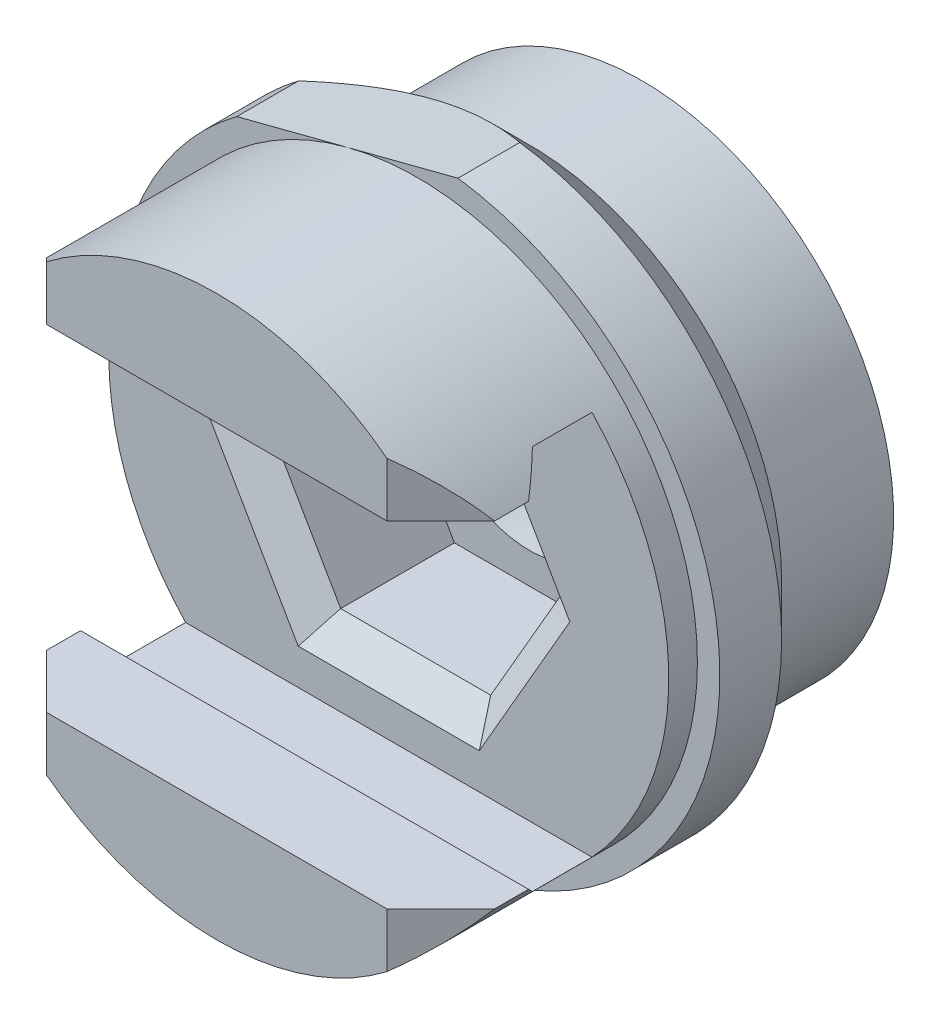
ISO-10303-21;
HEADER;
FILE_DESCRIPTION(('STEP AP214'),'2;1');
FILE_NAME('part.step','',(''),(''),'','','');
FILE_SCHEMA(('AUTOMOTIVE_DESIGN { 1 0 10303 214 1 1 1 1 }'));
ENDSEC;
DATA;
#1=APPLICATION_CONTEXT('core data for automotive mechanical design processes');
#2=APPLICATION_PROTOCOL_DEFINITION('international standard','automotive_design',2000,#1);
#3=PRODUCT_CONTEXT('',#1,'mechanical');
#4=PRODUCT('Part','Part','',(#3));
#5=PRODUCT_RELATED_PRODUCT_CATEGORY('part','',(#4));
#6=PRODUCT_DEFINITION_FORMATION('','',#4);
#7=PRODUCT_DEFINITION_CONTEXT('part definition',#1,'design');
#8=PRODUCT_DEFINITION('design','',#6,#7);
#9=PRODUCT_DEFINITION_SHAPE('','',#8);
#10=(LENGTH_UNIT() NAMED_UNIT(*) SI_UNIT(.MILLI.,.METRE.));
#11=(NAMED_UNIT(*) PLANE_ANGLE_UNIT() SI_UNIT($,.RADIAN.));
#12=(NAMED_UNIT(*) SI_UNIT($,.STERADIAN.) SOLID_ANGLE_UNIT());
#13=UNCERTAINTY_MEASURE_WITH_UNIT(LENGTH_MEASURE(1.E-05),#10,'distance_accuracy_value','');
#14=(GEOMETRIC_REPRESENTATION_CONTEXT(3) GLOBAL_UNCERTAINTY_ASSIGNED_CONTEXT((#13)) GLOBAL_UNIT_ASSIGNED_CONTEXT((#10,
#11,#12)) REPRESENTATION_CONTEXT('',''));
#15=CARTESIAN_POINT('',(0.,0.,0.));
#16=DIRECTION('',(0.,0.,1.));
#17=DIRECTION('',(1.,0.,0.));
#18=AXIS2_PLACEMENT_3D('',#15,#16,#17);
#19=CARTESIAN_POINT('',(-4.0005,0.,-4.7625));
#20=DIRECTION('',(0.,0.,1.));
#21=DIRECTION('',(1.,0.,0.));
#22=AXIS2_PLACEMENT_3D('',#19,#20,#21);
#23=PLANE('',#22);
#24=CARTESIAN_POINT('',(0.,0.,-4.7625));
#25=DIRECTION('',(0.,0.,-1.));
#26=DIRECTION('',(0.,1.,0.));
#27=AXIS2_PLACEMENT_3D('',#24,#25,#26);
#28=CIRCLE('',#27,2.80669999999999);
#29=CARTESIAN_POINT('',(0.,2.80669999999999,-4.7625));
#30=VERTEX_POINT('',#29);
#31=EDGE_CURVE('E270',#30,#30,#28,.T.);
#32=ORIENTED_EDGE('',*,*,#31,.F.);
#33=EDGE_LOOP('',(#32));
#34=FACE_BOUND('',#33,.T.);
#35=CARTESIAN_POINT('',(0.,0.,-4.7625));
#36=DIRECTION('',(0.,0.,1.));
#37=DIRECTION('',(1.,0.,0.));
#38=AXIS2_PLACEMENT_3D('',#35,#36,#37);
#39=CIRCLE('',#38,7.1501);
#40=CARTESIAN_POINT('',(-7.1501,0.,-4.7625));
#41=VERTEX_POINT('',#40);
#42=EDGE_CURVE('E331',#41,#41,#39,.T.);
#43=ORIENTED_EDGE('',*,*,#42,.F.);
#44=EDGE_LOOP('',(#43));
#45=FACE_BOUND('',#44,.T.);
#46=ADVANCED_FACE('F42',(#34,#45),#23,.F.);
#47=CARTESIAN_POINT('',(-5.12213463823965,6.87397214118194,0.));
#48=DIRECTION('',(0.250380004054442,-0.968147640378108,0.));
#49=DIRECTION('',(0.,0.,-1.));
#50=AXIS2_PLACEMENT_3D('',#47,#48,#49);
#51=PLANE('',#50);
#52=DIRECTION('',(-0.968147640378108,-0.250380004054442,0.));
#53=VECTOR('',#52,1.);
#54=CARTESIAN_POINT('',(0.16518552114385,8.24136610851793,1.5875));
#55=LINE('',#54,#53);
#56=CARTESIAN_POINT('',(1.14735207387538,8.49537164982051,1.5875));
#57=VERTEX_POINT('',#56);
#58=CARTESIAN_POINT('',(-1.98739128218214,7.68467189550124,1.5875));
#59=VERTEX_POINT('',#58);
#60=EDGE_CURVE('E286',#57,#59,#55,.T.);
#61=ORIENTED_EDGE('',*,*,#60,.F.);
#62=DIRECTION('',(0.,0.,1.));
#63=VECTOR('',#62,1.);
#64=CARTESIAN_POINT('',(1.14735207387539,8.49537164982051,0.79375));
#65=LINE('',#64,#63);
#66=CARTESIAN_POINT('',(1.14735207387541,8.49537164982049,-0.165100000000026));
#67=VERTEX_POINT('',#66);
#68=EDGE_CURVE('E306',#67,#57,#65,.T.);
#69=ORIENTED_EDGE('',*,*,#68,.F.);
#70=CARTESIAN_POINT('',(1.14735207387541,8.49537164982049,-0.165100000000026));
#71=CARTESIAN_POINT('',(1.02182780303465,8.46290886611762,-0.214067801987169));
#72=CARTESIAN_POINT('',(0.895501367073071,8.43023862840895,-0.260832186588379));
#73=CARTESIAN_POINT('',(0.641211831230228,8.36447488292229,-0.349496353381921));
#74=CARTESIAN_POINT('',(0.513248173068454,8.33138123076315,-0.391394424314616));
#75=CARTESIAN_POINT('',(0.126447368308832,8.2313477410093,-0.509216576987562));
#76=CARTESIAN_POINT('',(-0.134774459607805,8.16379118289247,-0.577059752636718));
#77=CARTESIAN_POINT('',(-0.659989385518245,8.02796136748586,-0.686894340049065));
#78=CARTESIAN_POINT('',(-0.923939447004469,7.9596992401937,-0.729102663577483));
#79=CARTESIAN_POINT('',(-1.45440054619594,7.82251267212603,-0.785686514579263));
#80=CARTESIAN_POINT('',(-1.72090837485248,7.75358906126694,-0.800093246787993));
#81=CARTESIAN_POINT('',(-2.22139457999775,7.62415452788883,-0.800105930113544));
#82=CARTESIAN_POINT('',(-2.45537866121993,7.56364213002541,-0.789008176094385));
#83=CARTESIAN_POINT('',(-2.92151896411421,7.44309005091997,-0.745268424823538));
#84=CARTESIAN_POINT('',(-3.15367447908062,7.38305055244446,-0.712618475317097));
#85=CARTESIAN_POINT('',(-3.61429812034423,7.26392517904365,-0.627546623985307));
#86=CARTESIAN_POINT('',(-3.84276924014285,7.20483852994625,-0.57514171430756));
#87=CARTESIAN_POINT('',(-4.29520055882294,7.08783183522225,-0.452961926980331));
#88=CARTESIAN_POINT('',(-4.51916227215143,7.02991139793303,-0.383192989733951));
#89=CARTESIAN_POINT('',(-4.80467241669743,6.95607345404144,-0.283727869644538));
#90=CARTESIAN_POINT('',(-4.86849796693992,6.93956704441754,-0.260802563334522));
#91=CARTESIAN_POINT('',(-4.99566014429292,6.90668066928908,-0.213803595856191));
#92=CARTESIAN_POINT('',(-5.05899728998349,6.89030056967059,-0.189731432261009));
#93=CARTESIAN_POINT('',(-5.12213463823967,6.87397214118193,-0.165100000000025));
#94=B_SPLINE_CURVE_WITH_KNOTS('',3,(#70,#71,#72,#73,#74,#75,#76,#77,#78,#79,#80,#81,#82,#83,#84,
#85,#86,#87,#88,#89,#90,#91,#92,#93),.UNSPECIFIED.,.F.,.F.,(4,2,2,2,2,2,2,2,2,2,2,4),(0.,
0.415743060070331,0.831631878107094,1.66514854976813,2.49151033956696,3.31694407337122,
4.041771859791,4.76686724027322,5.49134035080429,6.21556595189848,6.42495359680074,
6.63407494001335),.UNSPECIFIED.);
#95=CARTESIAN_POINT('',(-5.12213463823965,6.87397214118194,-0.165100000000026));
#96=VERTEX_POINT('',#95);
#97=EDGE_CURVE('E414',#67,#96,#94,.T.);
#98=ORIENTED_EDGE('',*,*,#97,.T.);
#99=DIRECTION('',(0.,0.,-1.));
#100=VECTOR('',#99,1.);
#101=CARTESIAN_POINT('',(-5.12213463823965,6.87397214118194,0.79375));
#102=LINE('',#101,#100);
#103=CARTESIAN_POINT('',(-5.12213463823965,6.87397214118194,1.5875));
#104=VERTEX_POINT('',#103);
#105=EDGE_CURVE('E304',#104,#96,#102,.T.);
#106=ORIENTED_EDGE('',*,*,#105,.F.);
#107=DIRECTION('',(-0.968147640378108,-0.250380004054442,0.));
#108=VECTOR('',#107,1.);
#109=CARTESIAN_POINT('',(0.16518552114385,8.24136610851793,1.5875));
#110=LINE('',#109,#108);
#111=EDGE_CURVE('E284',#59,#104,#110,.T.);
#112=ORIENTED_EDGE('',*,*,#111,.F.);
#113=EDGE_LOOP('',(#61,#69,#98,#106,#112));
#114=FACE_BOUND('',#113,.T.);
#115=ADVANCED_FACE('F425',(#114),#51,.F.);
#116=CARTESIAN_POINT('',(0.,0.,-9.3345));
#117=DIRECTION('',(0.,0.,1.));
#118=DIRECTION('',(1.,0.,0.));
#119=AXIS2_PLACEMENT_3D('',#116,#117,#118);
#120=CYLINDRICAL_SURFACE('',#119,7.1501);
#121=CARTESIAN_POINT('',(0.,0.,-1.58750000000001));
#122=DIRECTION('',(0.,0.,-1.));
#123=DIRECTION('',(-1.,0.,0.));
#124=AXIS2_PLACEMENT_3D('',#121,#122,#123);
#125=CIRCLE('',#124,7.1501);
#126=CARTESIAN_POINT('',(-7.1501,0.,-1.58750000000001));
#127=VERTEX_POINT('',#126);
#128=CARTESIAN_POINT('',(7.1501,0.,-1.58750000000001));
#129=VERTEX_POINT('',#128);
#130=EDGE_CURVE('E401',#127,#129,#125,.T.);
#131=ORIENTED_EDGE('',*,*,#130,.T.);
#132=CARTESIAN_POINT('',(0.,0.,-1.58750000000001));
#133=DIRECTION('',(0.,0.,-1.));
#134=DIRECTION('',(-1.,0.,0.));
#135=AXIS2_PLACEMENT_3D('',#132,#133,#134);
#136=CIRCLE('',#135,7.1501);
#137=EDGE_CURVE('E405',#129,#127,#136,.T.);
#138=ORIENTED_EDGE('',*,*,#137,.T.);
#139=DIRECTION('',(0.,0.,-1.));
#140=VECTOR('',#139,1.);
#141=CARTESIAN_POINT('',(-7.1501,0.,-9.3345));
#142=LINE('',#141,#140);
#143=EDGE_CURVE('E341',#127,#41,#142,.T.);
#144=ORIENTED_EDGE('',*,*,#143,.T.);
#145=ORIENTED_EDGE('',*,*,#42,.T.);
#146=ORIENTED_EDGE('',*,*,#143,.F.);
#147=EDGE_LOOP('',(#131,#138,#144,#145,#146));
#148=FACE_BOUND('',#147,.T.);
#149=ADVANCED_FACE('F467',(#148),#120,.T.);
#150=CARTESIAN_POINT('',(4.826,4.7625,7.2771));
#151=DIRECTION('',(-0.707106781186547,0.,-0.707106781186548));
#152=DIRECTION('',(-0.707106781186548,0.,0.707106781186547));
#153=AXIS2_PLACEMENT_3D('',#150,#151,#152);
#154=PLANE('',#153);
#155=DIRECTION('',(0.707106781186548,0.,-0.707106781186547));
#156=VECTOR('',#155,1.);
#157=CARTESIAN_POINT('',(3.6195,-4.7625,8.4836));
#158=LINE('',#157,#156);
#159=CARTESIAN_POINT('',(4.826,-4.7625,7.2771));
#160=VERTEX_POINT('',#159);
#161=CARTESIAN_POINT('',(6.35,-4.7625,5.7531));
#162=VERTEX_POINT('',#161);
#163=EDGE_CURVE('E363',#160,#162,#158,.T.);
#164=ORIENTED_EDGE('',*,*,#163,.F.);
#165=DIRECTION('',(0.,1.,0.));
#166=VECTOR('',#165,1.);
#167=CARTESIAN_POINT('',(4.826,2.38125,7.2771));
#168=LINE('',#167,#166);
#169=CARTESIAN_POINT('',(4.826,-6.30187513760788,7.2771));
#170=VERTEX_POINT('',#169);
#171=EDGE_CURVE('E338',#170,#160,#168,.T.);
#172=ORIENTED_EDGE('',*,*,#171,.F.);
#173=CARTESIAN_POINT('',(0.,0.,12.1031));
#174=DIRECTION('',(-0.707106781186547,0.,-0.707106781186548));
#175=DIRECTION('',(0.707106781186548,0.,-0.707106781186547));
#176=AXIS2_PLACEMENT_3D('',#173,#174,#175);
#177=ELLIPSE('',#176,11.2253201513365,7.9375);
#178=EDGE_CURVE('E348',#162,#170,#177,.T.);
#179=ORIENTED_EDGE('',*,*,#178,.F.);
#180=EDGE_LOOP('',(#164,#172,#179));
#181=FACE_BOUND('',#180,.T.);
#182=ADVANCED_FACE('F489',(#181),#154,.F.);
#183=CARTESIAN_POINT('',(4.826,4.7625,7.2771));
#184=DIRECTION('',(-0.707106781186547,0.,-0.707106781186548));
#185=DIRECTION('',(-0.707106781186548,0.,0.707106781186547));
#186=AXIS2_PLACEMENT_3D('',#183,#184,#185);
#187=PLANE('',#186);
#188=DIRECTION('',(-0.707106781186548,0.,0.707106781186547));
#189=VECTOR('',#188,1.);
#190=CARTESIAN_POINT('',(4.4323,4.7625,7.6708));
#191=LINE('',#190,#189);
#192=CARTESIAN_POINT('',(6.35,4.7625,5.7531));
#193=VERTEX_POINT('',#192);
#194=CARTESIAN_POINT('',(4.826,4.7625,7.2771));
#195=VERTEX_POINT('',#194);
#196=EDGE_CURVE('E296',#193,#195,#191,.T.);
#197=ORIENTED_EDGE('',*,*,#196,.F.);
#198=CARTESIAN_POINT('',(0.,0.,12.1031));
#199=DIRECTION('',(-0.707106781186547,0.,-0.707106781186548));
#200=DIRECTION('',(0.707106781186548,0.,-0.707106781186547));
#201=AXIS2_PLACEMENT_3D('',#198,#199,#200);
#202=ELLIPSE('',#201,11.2253201513365,7.9375);
#203=CARTESIAN_POINT('',(4.826,6.30187513760788,7.2771));
#204=VERTEX_POINT('',#203);
#205=EDGE_CURVE('E346',#204,#193,#202,.T.);
#206=ORIENTED_EDGE('',*,*,#205,.F.);
#207=DIRECTION('',(0.,1.,0.));
#208=VECTOR('',#207,1.);
#209=CARTESIAN_POINT('',(4.826,2.38125,7.2771));
#210=LINE('',#209,#208);
#211=EDGE_CURVE('E290',#195,#204,#210,.T.);
#212=ORIENTED_EDGE('',*,*,#211,.F.);
#213=EDGE_LOOP('',(#197,#206,#212));
#214=FACE_BOUND('',#213,.T.);
#215=ADVANCED_FACE('F503',(#214),#187,.F.);
#216=CARTESIAN_POINT('',(-6.35,4.7625,5.7531));
#217=DIRECTION('',(0.707106781186548,0.,-0.707106781186548));
#218=DIRECTION('',(0.,-1.,0.));
#219=AXIS2_PLACEMENT_3D('',#216,#217,#218);
#220=PLANE('',#219);
#221=DIRECTION('',(0.707106781186548,0.,0.707106781186548));
#222=VECTOR('',#221,1.);
#223=CARTESIAN_POINT('',(-4.3815,-4.7625,7.7216));
#224=LINE('',#223,#222);
#225=CARTESIAN_POINT('',(-6.35,-4.7625,5.7531));
#226=VERTEX_POINT('',#225);
#227=CARTESIAN_POINT('',(-4.826,-4.7625,7.2771));
#228=VERTEX_POINT('',#227);
#229=EDGE_CURVE('E328',#226,#228,#224,.T.);
#230=ORIENTED_EDGE('',*,*,#229,.F.);
#231=CARTESIAN_POINT('',(0.,0.,12.1031));
#232=DIRECTION('',(0.707106781186548,0.,-0.707106781186548));
#233=DIRECTION('',(0.707106781186548,0.,0.707106781186548));
#234=AXIS2_PLACEMENT_3D('',#231,#232,#233);
#235=ELLIPSE('',#234,11.2253201513365,7.9375);
#236=CARTESIAN_POINT('',(-4.826,-6.30187513760788,7.2771));
#237=VERTEX_POINT('',#236);
#238=EDGE_CURVE('E349',#237,#226,#235,.T.);
#239=ORIENTED_EDGE('',*,*,#238,.F.);
#240=DIRECTION('',(0.,-1.,0.));
#241=VECTOR('',#240,1.);
#242=CARTESIAN_POINT('',(-4.826,2.38125,7.2771));
#243=LINE('',#242,#241);
#244=EDGE_CURVE('E295',#228,#237,#243,.T.);
#245=ORIENTED_EDGE('',*,*,#244,.F.);
#246=EDGE_LOOP('',(#230,#239,#245));
#247=FACE_BOUND('',#246,.T.);
#248=ADVANCED_FACE('F505',(#247),#220,.F.);
#249=CARTESIAN_POINT('',(-6.35,4.7625,5.7531));
#250=DIRECTION('',(0.707106781186548,0.,-0.707106781186548));
#251=DIRECTION('',(0.,-1.,0.));
#252=AXIS2_PLACEMENT_3D('',#249,#250,#251);
#253=PLANE('',#252);
#254=DIRECTION('',(-0.707106781186548,0.,-0.707106781186548));
#255=VECTOR('',#254,1.);
#256=CARTESIAN_POINT('',(-5.1943,4.7625,6.9088));
#257=LINE('',#256,#255);
#258=CARTESIAN_POINT('',(-4.826,4.7625,7.2771));
#259=VERTEX_POINT('',#258);
#260=CARTESIAN_POINT('',(-6.35,4.7625,5.7531));
#261=VERTEX_POINT('',#260);
#262=EDGE_CURVE('E320',#259,#261,#257,.T.);
#263=ORIENTED_EDGE('',*,*,#262,.F.);
#264=DIRECTION('',(0.,-1.,0.));
#265=VECTOR('',#264,1.);
#266=CARTESIAN_POINT('',(-4.826,2.38125,7.2771));
#267=LINE('',#266,#265);
#268=CARTESIAN_POINT('',(-4.826,6.30187513760788,7.2771));
#269=VERTEX_POINT('',#268);
#270=EDGE_CURVE('E291',#269,#259,#267,.T.);
#271=ORIENTED_EDGE('',*,*,#270,.F.);
#272=CARTESIAN_POINT('',(0.,0.,12.1031));
#273=DIRECTION('',(0.707106781186548,0.,-0.707106781186548));
#274=DIRECTION('',(0.707106781186548,0.,0.707106781186548));
#275=AXIS2_PLACEMENT_3D('',#272,#273,#274);
#276=ELLIPSE('',#275,11.2253201513365,7.9375);
#277=EDGE_CURVE('E303',#261,#269,#276,.T.);
#278=ORIENTED_EDGE('',*,*,#277,.F.);
#279=EDGE_LOOP('',(#263,#271,#278));
#280=FACE_BOUND('',#279,.T.);
#281=ADVANCED_FACE('F501',(#280),#253,.F.);
#282=CARTESIAN_POINT('',(0.,0.,7.2771));
#283=DIRECTION('',(0.,0.,1.));
#284=DIRECTION('',(1.,0.,0.));
#285=AXIS2_PLACEMENT_3D('',#282,#283,#284);
#286=PLANE('',#285);
#287=ORIENTED_EDGE('',*,*,#211,.T.);
#288=CARTESIAN_POINT('',(0.,0.,7.2771));
#289=DIRECTION('',(0.,0.,1.));
#290=DIRECTION('',(1.,0.,0.));
#291=AXIS2_PLACEMENT_3D('',#288,#289,#290);
#292=CIRCLE('',#291,7.9375);
#293=EDGE_CURVE('E287',#204,#269,#292,.T.);
#294=ORIENTED_EDGE('',*,*,#293,.T.);
#295=ORIENTED_EDGE('',*,*,#270,.T.);
#296=DIRECTION('',(1.,0.,0.));
#297=VECTOR('',#296,1.);
#298=CARTESIAN_POINT('',(0.,4.7625,7.2771));
#299=LINE('',#298,#297);
#300=EDGE_CURVE('E334',#259,#195,#299,.T.);
#301=ORIENTED_EDGE('',*,*,#300,.T.);
#302=EDGE_LOOP('',(#287,#294,#295,#301));
#303=FACE_BOUND('',#302,.T.);
#304=ADVANCED_FACE('F479',(#303),#286,.T.);
#305=CARTESIAN_POINT('',(0.,0.,4.4323));
#306=DIRECTION('',(0.,0.,1.));
#307=DIRECTION('',(1.,0.,0.));
#308=AXIS2_PLACEMENT_3D('',#305,#306,#307);
#309=CYLINDRICAL_SURFACE('',#308,7.9375);
#310=DIRECTION('',(0.,0.,1.));
#311=VECTOR('',#310,1.);
#312=CARTESIAN_POINT('',(5.76032857135774,-5.461,4.4323));
#313=LINE('',#312,#311);
#314=CARTESIAN_POINT('',(5.76032857135774,-5.461,2.4003));
#315=VERTEX_POINT('',#314);
#316=CARTESIAN_POINT('',(5.76032857135771,-5.461,4.08940000000001));
#317=VERTEX_POINT('',#316);
#318=EDGE_CURVE('E299',#315,#317,#313,.T.);
#319=ORIENTED_EDGE('',*,*,#318,.T.);
#320=CARTESIAN_POINT('',(0.,0.,9.55039999999996));
#321=DIRECTION('',(0.,-0.707106781186544,0.707106781186551));
#322=DIRECTION('',(0.,0.707106781186551,0.707106781186544));
#323=AXIS2_PLACEMENT_3D('',#320,#321,#322);
#324=ELLIPSE('',#323,11.2253201513364,7.9375);
#325=CARTESIAN_POINT('',(6.35,-4.7625,4.78790000000001));
#326=VERTEX_POINT('',#325);
#327=EDGE_CURVE('E387',#317,#326,#324,.T.);
#328=ORIENTED_EDGE('',*,*,#327,.T.);
#329=DIRECTION('',(0.,0.,1.));
#330=VECTOR('',#329,1.);
#331=CARTESIAN_POINT('',(6.35,-4.7625,4.4323));
#332=LINE('',#331,#330);
#333=EDGE_CURVE('E310',#326,#162,#332,.T.);
#334=ORIENTED_EDGE('',*,*,#333,.T.);
#335=ORIENTED_EDGE('',*,*,#178,.T.);
#336=CARTESIAN_POINT('',(0.,0.,7.2771));
#337=DIRECTION('',(0.,0.,1.));
#338=DIRECTION('',(1.,0.,0.));
#339=AXIS2_PLACEMENT_3D('',#336,#337,#338);
#340=CIRCLE('',#339,7.9375);
#341=EDGE_CURVE('E292',#237,#170,#340,.T.);
#342=ORIENTED_EDGE('',*,*,#341,.F.);
#343=ORIENTED_EDGE('',*,*,#238,.T.);
#344=DIRECTION('',(0.,0.,-1.));
#345=VECTOR('',#344,1.);
#346=CARTESIAN_POINT('',(-6.35,-4.7625,4.4323));
#347=LINE('',#346,#345);
#348=CARTESIAN_POINT('',(-6.35,-4.7625,4.78790000000001));
#349=VERTEX_POINT('',#348);
#350=EDGE_CURVE('E352',#226,#349,#347,.T.);
#351=ORIENTED_EDGE('',*,*,#350,.T.);
#352=CARTESIAN_POINT('',(0.,0.,9.55039999999996));
#353=DIRECTION('',(0.,-0.707106781186544,0.707106781186551));
#354=DIRECTION('',(0.,0.707106781186551,0.707106781186544));
#355=AXIS2_PLACEMENT_3D('',#352,#353,#354);
#356=ELLIPSE('',#355,11.2253201513364,7.9375);
#357=CARTESIAN_POINT('',(-5.76032857135771,-5.461,4.08940000000001));
#358=VERTEX_POINT('',#357);
#359=EDGE_CURVE('E384',#349,#358,#356,.T.);
#360=ORIENTED_EDGE('',*,*,#359,.T.);
#361=DIRECTION('',(0.,0.,-1.));
#362=VECTOR('',#361,1.);
#363=CARTESIAN_POINT('',(-5.76032857135774,-5.461,4.4323));
#364=LINE('',#363,#362);
#365=CARTESIAN_POINT('',(-5.76032857135774,-5.461,2.4003));
#366=VERTEX_POINT('',#365);
#367=EDGE_CURVE('E314',#358,#366,#364,.T.);
#368=ORIENTED_EDGE('',*,*,#367,.T.);
#369=CARTESIAN_POINT('',(0.,0.,2.4003));
#370=DIRECTION('',(0.,0.,-1.));
#371=DIRECTION('',(1.,0.,0.));
#372=AXIS2_PLACEMENT_3D('',#369,#370,#371);
#373=CIRCLE('',#372,7.9375);
#374=CARTESIAN_POINT('',(-7.9375,0.,2.4003));
#375=VERTEX_POINT('',#374);
#376=EDGE_CURVE('E311',#366,#375,#373,.T.);
#377=ORIENTED_EDGE('',*,*,#376,.T.);
#378=DIRECTION('',(0.,0.,-1.));
#379=VECTOR('',#378,1.);
#380=CARTESIAN_POINT('',(-7.9375,0.,4.4323));
#381=LINE('',#380,#379);
#382=CARTESIAN_POINT('',(-7.9375,0.,1.5875));
#383=VERTEX_POINT('',#382);
#384=EDGE_CURVE('E282',#375,#383,#381,.T.);
#385=ORIENTED_EDGE('',*,*,#384,.T.);
#386=CARTESIAN_POINT('',(0.,0.,1.5875));
#387=DIRECTION('',(0.,0.,1.));
#388=DIRECTION('',(1.,0.,0.));
#389=AXIS2_PLACEMENT_3D('',#386,#387,#388);
#390=CIRCLE('',#389,7.9375);
#391=EDGE_CURVE('E279',#383,#59,#390,.T.);
#392=ORIENTED_EDGE('',*,*,#391,.T.);
#393=CARTESIAN_POINT('',(0.,0.,1.5875));
#394=DIRECTION('',(0.,0.,1.));
#395=DIRECTION('',(1.,0.,0.));
#396=AXIS2_PLACEMENT_3D('',#393,#394,#395);
#397=CIRCLE('',#396,7.9375);
#398=EDGE_CURVE('E283',#59,#383,#397,.T.);
#399=ORIENTED_EDGE('',*,*,#398,.T.);
#400=ORIENTED_EDGE('',*,*,#384,.F.);
#401=CARTESIAN_POINT('',(0.,0.,2.4003));
#402=DIRECTION('',(0.,0.,-1.));
#403=DIRECTION('',(1.,0.,0.));
#404=AXIS2_PLACEMENT_3D('',#401,#402,#403);
#405=CIRCLE('',#404,7.9375);
#406=CARTESIAN_POINT('',(-5.76032857135774,5.461,2.4003));
#407=VERTEX_POINT('',#406);
#408=EDGE_CURVE('E335',#375,#407,#405,.T.);
#409=ORIENTED_EDGE('',*,*,#408,.T.);
#410=DIRECTION('',(0.,0.,1.));
#411=VECTOR('',#410,1.);
#412=CARTESIAN_POINT('',(-5.76032857135774,5.461,4.4323));
#413=LINE('',#412,#411);
#414=CARTESIAN_POINT('',(-5.76032857135771,5.461,4.08940000000001));
#415=VERTEX_POINT('',#414);
#416=EDGE_CURVE('E302',#407,#415,#413,.T.);
#417=ORIENTED_EDGE('',*,*,#416,.T.);
#418=CARTESIAN_POINT('',(0.,0.,9.55040000000008));
#419=DIRECTION('',(0.,0.707106781186552,0.707106781186543));
#420=DIRECTION('',(0.,-0.707106781186543,0.707106781186552));
#421=AXIS2_PLACEMENT_3D('',#418,#419,#420);
#422=ELLIPSE('',#421,11.2253201513365,7.9375);
#423=CARTESIAN_POINT('',(-6.35,4.7625,4.78790000000002));
#424=VERTEX_POINT('',#423);
#425=EDGE_CURVE('E343',#415,#424,#422,.T.);
#426=ORIENTED_EDGE('',*,*,#425,.T.);
#427=DIRECTION('',(0.,0.,1.));
#428=VECTOR('',#427,1.);
#429=CARTESIAN_POINT('',(-6.35,4.7625,4.4323));
#430=LINE('',#429,#428);
#431=EDGE_CURVE('E300',#424,#261,#430,.T.);
#432=ORIENTED_EDGE('',*,*,#431,.T.);
#433=ORIENTED_EDGE('',*,*,#277,.T.);
#434=ORIENTED_EDGE('',*,*,#293,.F.);
#435=ORIENTED_EDGE('',*,*,#205,.T.);
#436=DIRECTION('',(0.,0.,-1.));
#437=VECTOR('',#436,1.);
#438=CARTESIAN_POINT('',(6.35,4.7625,4.4323));
#439=LINE('',#438,#437);
#440=CARTESIAN_POINT('',(6.35,4.7625,4.78790000000002));
#441=VERTEX_POINT('',#440);
#442=EDGE_CURVE('E277',#193,#441,#439,.T.);
#443=ORIENTED_EDGE('',*,*,#442,.T.);
#444=CARTESIAN_POINT('',(0.,0.,9.55040000000008));
#445=DIRECTION('',(0.,0.707106781186552,0.707106781186543));
#446=DIRECTION('',(0.,-0.707106781186543,0.707106781186552));
#447=AXIS2_PLACEMENT_3D('',#444,#445,#446);
#448=ELLIPSE('',#447,11.2253201513365,7.9375);
#449=CARTESIAN_POINT('',(5.76032857135771,5.461,4.08940000000001));
#450=VERTEX_POINT('',#449);
#451=EDGE_CURVE('E381',#441,#450,#448,.T.);
#452=ORIENTED_EDGE('',*,*,#451,.T.);
#453=DIRECTION('',(0.,0.,-1.));
#454=VECTOR('',#453,1.);
#455=CARTESIAN_POINT('',(5.76032857135774,5.461,4.4323));
#456=LINE('',#455,#454);
#457=CARTESIAN_POINT('',(5.76032857135774,5.461,2.4003));
#458=VERTEX_POINT('',#457);
#459=EDGE_CURVE('E274',#450,#458,#456,.T.);
#460=ORIENTED_EDGE('',*,*,#459,.T.);
#461=CARTESIAN_POINT('',(0.,0.,2.4003));
#462=DIRECTION('',(0.,0.,-1.));
#463=DIRECTION('',(1.,0.,0.));
#464=AXIS2_PLACEMENT_3D('',#461,#462,#463);
#465=CIRCLE('',#464,7.9375);
#466=EDGE_CURVE('E278',#458,#315,#465,.T.);
#467=ORIENTED_EDGE('',*,*,#466,.T.);
#468=EDGE_LOOP('',(#319,#328,#334,#335,#342,#343,#351,#360,#368,#377,#385,#392,#399,#400,#409,
#417,#426,#432,#433,#434,#435,#443,#452,#460,#467));
#469=FACE_BOUND('',#468,.T.);
#470=ADVANCED_FACE('F475',(#469),#309,.T.);
#471=CARTESIAN_POINT('',(0.,0.,7.2771));
#472=DIRECTION('',(0.,0.,1.));
#473=DIRECTION('',(1.,0.,0.));
#474=AXIS2_PLACEMENT_3D('',#471,#472,#473);
#475=PLANE('',#474);
#476=ORIENTED_EDGE('',*,*,#171,.T.);
#477=DIRECTION('',(-1.,0.,0.));
#478=VECTOR('',#477,1.);
#479=CARTESIAN_POINT('',(0.,-4.7625,7.2771));
#480=LINE('',#479,#478);
#481=EDGE_CURVE('E308',#160,#228,#480,.T.);
#482=ORIENTED_EDGE('',*,*,#481,.T.);
#483=ORIENTED_EDGE('',*,*,#244,.T.);
#484=ORIENTED_EDGE('',*,*,#341,.T.);
#485=EDGE_LOOP('',(#476,#482,#483,#484));
#486=FACE_BOUND('',#485,.T.);
#487=ADVANCED_FACE('F478',(#486),#475,.T.);
#488=CARTESIAN_POINT('',(0.,4.7625,4.0259));
#489=DIRECTION('',(0.,1.,0.));
#490=DIRECTION('',(1.,0.,0.));
#491=AXIS2_PLACEMENT_3D('',#488,#489,#490);
#492=PLANE('',#491);
#493=ORIENTED_EDGE('',*,*,#431,.F.);
#494=DIRECTION('',(1.,0.,0.));
#495=VECTOR('',#494,1.);
#496=CARTESIAN_POINT('',(0.,4.7625,4.78790000000002));
#497=LINE('',#496,#495);
#498=EDGE_CURVE('E392',#424,#441,#497,.T.);
#499=ORIENTED_EDGE('',*,*,#498,.T.);
#500=ORIENTED_EDGE('',*,*,#442,.F.);
#501=ORIENTED_EDGE('',*,*,#196,.T.);
#502=ORIENTED_EDGE('',*,*,#300,.F.);
#503=ORIENTED_EDGE('',*,*,#262,.T.);
#504=EDGE_LOOP('',(#493,#499,#500,#501,#502,#503));
#505=FACE_BOUND('',#504,.T.);
#506=ADVANCED_FACE('F493',(#505),#492,.F.);
#507=CARTESIAN_POINT('',(0.,5.461,2.4003));
#508=DIRECTION('',(0.,1.,0.));
#509=DIRECTION('',(1.,0.,0.));
#510=AXIS2_PLACEMENT_3D('',#507,#508,#509);
#511=PLANE('',#510);
#512=ORIENTED_EDGE('',*,*,#459,.F.);
#513=DIRECTION('',(1.,0.,0.));
#514=VECTOR('',#513,1.);
#515=CARTESIAN_POINT('',(0.,5.461,4.08940000000001));
#516=LINE('',#515,#514);
#517=EDGE_CURVE('E398',#450,#415,#516,.F.);
#518=ORIENTED_EDGE('',*,*,#517,.T.);
#519=ORIENTED_EDGE('',*,*,#416,.F.);
#520=DIRECTION('',(1.,0.,0.));
#521=VECTOR('',#520,1.);
#522=CARTESIAN_POINT('',(0.,5.461,2.4003));
#523=LINE('',#522,#521);
#524=EDGE_CURVE('E317',#407,#458,#523,.T.);
#525=ORIENTED_EDGE('',*,*,#524,.T.);
#526=EDGE_LOOP('',(#512,#518,#519,#525));
#527=FACE_BOUND('',#526,.T.);
#528=ADVANCED_FACE('F485',(#527),#511,.F.);
#529=CARTESIAN_POINT('',(0.,-5.461,2.4003));
#530=DIRECTION('',(0.,0.,-1.));
#531=DIRECTION('',(-1.,0.,0.));
#532=AXIS2_PLACEMENT_3D('',#529,#530,#531);
#533=PLANE('',#532);
#534=DIRECTION('',(-0.5,-0.866025403784439,0.));
#535=VECTOR('',#534,1.);
#536=CARTESIAN_POINT('',(1.48480055478842,-6.31825,2.4003));
#537=LINE('',#536,#535);
#538=CARTESIAN_POINT('',(5.13264389309577,0.,2.4003));
#539=VERTEX_POINT('',#538);
#540=CARTESIAN_POINT('',(2.56632194654789,-4.445,2.4003));
#541=VERTEX_POINT('',#540);
#542=EDGE_CURVE('E562',#539,#541,#537,.T.);
#543=ORIENTED_EDGE('',*,*,#542,.T.);
#544=DIRECTION('',(-1.,0.,0.));
#545=VECTOR('',#544,1.);
#546=CARTESIAN_POINT('',(0.,-4.445,2.4003));
#547=LINE('',#546,#545);
#548=CARTESIAN_POINT('',(-2.56632194654788,-4.445,2.4003));
#549=VERTEX_POINT('',#548);
#550=EDGE_CURVE('E572',#541,#549,#547,.T.);
#551=ORIENTED_EDGE('',*,*,#550,.T.);
#552=DIRECTION('',(-0.5,0.866025403784438,0.));
#553=VECTOR('',#552,1.);
#554=CARTESIAN_POINT('',(-1.48480055478841,-6.31825,2.4003));
#555=LINE('',#554,#553);
#556=CARTESIAN_POINT('',(-5.13264389309577,0.,2.4003));
#557=VERTEX_POINT('',#556);
#558=EDGE_CURVE('E570',#549,#557,#555,.T.);
#559=ORIENTED_EDGE('',*,*,#558,.T.);
#560=DIRECTION('',(0.5,0.866025403784439,0.));
#561=VECTOR('',#560,1.);
#562=CARTESIAN_POINT('',(-6.21416528485523,-1.87325,2.4003));
#563=LINE('',#562,#561);
#564=CARTESIAN_POINT('',(-2.56632194654788,4.445,2.4003));
#565=VERTEX_POINT('',#564);
#566=EDGE_CURVE('E568',#557,#565,#563,.T.);
#567=ORIENTED_EDGE('',*,*,#566,.T.);
#568=DIRECTION('',(1.,0.,0.));
#569=VECTOR('',#568,1.);
#570=CARTESIAN_POINT('',(0.,4.445,2.4003));
#571=LINE('',#570,#569);
#572=CARTESIAN_POINT('',(2.56632194654788,4.445,2.4003));
#573=VERTEX_POINT('',#572);
#574=EDGE_CURVE('E566',#565,#573,#571,.T.);
#575=ORIENTED_EDGE('',*,*,#574,.T.);
#576=DIRECTION('',(0.5,-0.866025403784438,0.));
#577=VECTOR('',#576,1.);
#578=CARTESIAN_POINT('',(6.21416528485524,-1.87325,2.4003));
#579=LINE('',#578,#577);
#580=EDGE_CURVE('E564',#573,#539,#579,.T.);
#581=ORIENTED_EDGE('',*,*,#580,.T.);
#582=EDGE_LOOP('',(#543,#551,#559,#567,#575,#581));
#583=FACE_BOUND('',#582,.T.);
#584=ORIENTED_EDGE('',*,*,#466,.F.);
#585=ORIENTED_EDGE('',*,*,#524,.F.);
#586=ORIENTED_EDGE('',*,*,#408,.F.);
#587=ORIENTED_EDGE('',*,*,#376,.F.);
#588=DIRECTION('',(1.,0.,0.));
#589=VECTOR('',#588,1.);
#590=CARTESIAN_POINT('',(0.,-5.461,2.4003));
#591=LINE('',#590,#589);
#592=EDGE_CURVE('E321',#366,#315,#591,.T.);
#593=ORIENTED_EDGE('',*,*,#592,.T.);
#594=EDGE_LOOP('',(#584,#585,#586,#587,#593));
#595=FACE_BOUND('',#594,.T.);
#596=ADVANCED_FACE('F481',(#583,#595),#533,.F.);
#597=CARTESIAN_POINT('',(0.,-5.461,4.0259));
#598=DIRECTION('',(0.,-1.,0.));
#599=DIRECTION('',(0.,0.,-1.));
#600=AXIS2_PLACEMENT_3D('',#597,#598,#599);
#601=PLANE('',#600);
#602=ORIENTED_EDGE('',*,*,#318,.F.);
#603=ORIENTED_EDGE('',*,*,#592,.F.);
#604=ORIENTED_EDGE('',*,*,#367,.F.);
#605=DIRECTION('',(-1.,0.,0.));
#606=VECTOR('',#605,1.);
#607=CARTESIAN_POINT('',(0.,-5.461,4.08940000000001));
#608=LINE('',#607,#606);
#609=EDGE_CURVE('E395',#358,#317,#608,.F.);
#610=ORIENTED_EDGE('',*,*,#609,.T.);
#611=EDGE_LOOP('',(#602,#603,#604,#610));
#612=FACE_BOUND('',#611,.T.);
#613=ADVANCED_FACE('F484',(#612),#601,.F.);
#614=CARTESIAN_POINT('',(0.,-4.7625,7.2771));
#615=DIRECTION('',(0.,-1.,0.));
#616=DIRECTION('',(0.,0.,-1.));
#617=AXIS2_PLACEMENT_3D('',#614,#615,#616);
#618=PLANE('',#617);
#619=ORIENTED_EDGE('',*,*,#333,.F.);
#620=DIRECTION('',(-1.,0.,0.));
#621=VECTOR('',#620,1.);
#622=CARTESIAN_POINT('',(0.,-4.7625,4.78790000000001));
#623=LINE('',#622,#621);
#624=EDGE_CURVE('E389',#326,#349,#623,.T.);
#625=ORIENTED_EDGE('',*,*,#624,.T.);
#626=ORIENTED_EDGE('',*,*,#350,.F.);
#627=ORIENTED_EDGE('',*,*,#229,.T.);
#628=ORIENTED_EDGE('',*,*,#481,.F.);
#629=ORIENTED_EDGE('',*,*,#163,.T.);
#630=EDGE_LOOP('',(#619,#625,#626,#627,#628,#629));
#631=FACE_BOUND('',#630,.T.);
#632=ADVANCED_FACE('F495',(#631),#618,.F.);
#633=CARTESIAN_POINT('',(0.,0.,0.79375));
#634=DIRECTION('',(0.,0.,1.));
#635=DIRECTION('',(0.250380004054443,-0.968147640378107,0.));
#636=AXIS2_PLACEMENT_3D('',#633,#634,#635);
#637=CYLINDRICAL_SURFACE('',#636,8.5725);
#638=ORIENTED_EDGE('',*,*,#105,.T.);
#639=CARTESIAN_POINT('',(0.,0.,-0.165100000000026));
#640=DIRECTION('',(0.,0.,1.));
#641=DIRECTION('',(1.,0.,0.));
#642=AXIS2_PLACEMENT_3D('',#639,#640,#641);
#643=CIRCLE('',#642,8.5725);
#644=CARTESIAN_POINT('',(-8.5725,0.,-0.165100000000026));
#645=VERTEX_POINT('',#644);
#646=EDGE_CURVE('E423',#96,#645,#643,.T.);
#647=ORIENTED_EDGE('',*,*,#646,.T.);
#648=CARTESIAN_POINT('',(0.,0.,-0.165100000000026));
#649=DIRECTION('',(0.,0.,1.));
#650=DIRECTION('',(1.,0.,0.));
#651=AXIS2_PLACEMENT_3D('',#648,#649,#650);
#652=CIRCLE('',#651,8.5725);
#653=CARTESIAN_POINT('',(8.5725,0.,-0.165100000000026));
#654=VERTEX_POINT('',#653);
#655=EDGE_CURVE('E408',#645,#654,#652,.T.);
#656=ORIENTED_EDGE('',*,*,#655,.T.);
#657=CARTESIAN_POINT('',(0.,0.,-0.165100000000026));
#658=DIRECTION('',(0.,0.,1.));
#659=DIRECTION('',(1.,0.,0.));
#660=AXIS2_PLACEMENT_3D('',#657,#658,#659);
#661=CIRCLE('',#660,8.5725);
#662=EDGE_CURVE('E411',#654,#67,#661,.T.);
#663=ORIENTED_EDGE('',*,*,#662,.T.);
#664=ORIENTED_EDGE('',*,*,#68,.T.);
#665=CARTESIAN_POINT('',(0.,0.,1.5875));
#666=DIRECTION('',(0.,0.,1.));
#667=DIRECTION('',(1.,0.,0.));
#668=AXIS2_PLACEMENT_3D('',#665,#666,#667);
#669=CIRCLE('',#668,8.5725);
#670=EDGE_CURVE('E273',#104,#57,#669,.T.);
#671=ORIENTED_EDGE('',*,*,#670,.F.);
#672=EDGE_LOOP('',(#638,#647,#656,#663,#664,#671));
#673=FACE_BOUND('',#672,.T.);
#674=ADVANCED_FACE('F498',(#673),#637,.T.);
#675=CARTESIAN_POINT('',(7.9375,0.,1.5875));
#676=DIRECTION('',(0.,0.,1.));
#677=DIRECTION('',(1.,0.,0.));
#678=AXIS2_PLACEMENT_3D('',#675,#676,#677);
#679=PLANE('',#678);
#680=ORIENTED_EDGE('',*,*,#60,.T.);
#681=ORIENTED_EDGE('',*,*,#391,.F.);
#682=ORIENTED_EDGE('',*,*,#398,.F.);
#683=ORIENTED_EDGE('',*,*,#111,.T.);
#684=ORIENTED_EDGE('',*,*,#670,.T.);
#685=EDGE_LOOP('',(#680,#681,#682,#683,#684));
#686=FACE_BOUND('',#685,.T.);
#687=ADVANCED_FACE('F473',(#686),#679,.T.);
#688=CARTESIAN_POINT('',(0.,0.,-4.7625));
#689=DIRECTION('',(0.,0.,-1.));
#690=DIRECTION('',(0.,1.,0.));
#691=AXIS2_PLACEMENT_3D('',#688,#689,#690);
#692=CYLINDRICAL_SURFACE('',#691,2.80669999999999);
#693=CARTESIAN_POINT('',(0.,0.,-1.5875));
#694=DIRECTION('',(0.,0.,-1.));
#695=DIRECTION('',(-1.,0.,0.));
#696=AXIS2_PLACEMENT_3D('',#693,#694,#695);
#697=CIRCLE('',#696,2.80669999999999);
#698=CARTESIAN_POINT('',(-2.80669999999999,0.,-1.5875));
#699=VERTEX_POINT('',#698);
#700=EDGE_CURVE('E269',#699,#699,#697,.F.);
#701=ORIENTED_EDGE('',*,*,#700,.T.);
#702=EDGE_LOOP('',(#701));
#703=FACE_BOUND('',#702,.T.);
#704=ORIENTED_EDGE('',*,*,#31,.T.);
#705=EDGE_LOOP('',(#704));
#706=FACE_BOUND('',#705,.T.);
#707=ADVANCED_FACE('F625',(#703,#706),#692,.F.);
#708=CARTESIAN_POINT('',(0.,-5.52450000000001,4.0259));
#709=DIRECTION('',(0.,-0.707106781186544,0.707106781186551));
#710=DIRECTION('',(1.,0.,0.));
#711=AXIS2_PLACEMENT_3D('',#708,#709,#710);
#712=PLANE('',#711);
#713=ORIENTED_EDGE('',*,*,#359,.F.);
#714=ORIENTED_EDGE('',*,*,#624,.F.);
#715=ORIENTED_EDGE('',*,*,#327,.F.);
#716=ORIENTED_EDGE('',*,*,#609,.F.);
#717=EDGE_LOOP('',(#713,#714,#715,#716));
#718=FACE_BOUND('',#717,.T.);
#719=ADVANCED_FACE('F539',(#718),#712,.F.);
#720=CARTESIAN_POINT('',(0.,4.7625,4.78790000000002));
#721=DIRECTION('',(0.,0.707106781186552,0.707106781186543));
#722=DIRECTION('',(1.,0.,0.));
#723=AXIS2_PLACEMENT_3D('',#720,#721,#722);
#724=PLANE('',#723);
#725=ORIENTED_EDGE('',*,*,#425,.F.);
#726=ORIENTED_EDGE('',*,*,#517,.F.);
#727=ORIENTED_EDGE('',*,*,#451,.F.);
#728=ORIENTED_EDGE('',*,*,#498,.F.);
#729=EDGE_LOOP('',(#725,#726,#727,#728));
#730=FACE_BOUND('',#729,.T.);
#731=ADVANCED_FACE('F523',(#730),#724,.F.);
#732=CARTESIAN_POINT('',(8.5725,0.,-1.5875));
#733=DIRECTION('',(0.,0.,-1.));
#734=DIRECTION('',(0.,-1.,0.));
#735=AXIS2_PLACEMENT_3D('',#732,#733,#734);
#736=PLANE('',#735);
#737=DIRECTION('',(-0.5,0.866025403784438,0.));
#738=VECTOR('',#737,1.);
#739=CARTESIAN_POINT('',(4.25276208285078,0.,-1.5875));
#740=LINE('',#739,#738);
#741=CARTESIAN_POINT('',(4.25276208285078,0.,-1.5875));
#742=VERTEX_POINT('',#741);
#743=CARTESIAN_POINT('',(2.12638104142539,3.683,-1.5875));
#744=VERTEX_POINT('',#743);
#745=EDGE_CURVE('E245',#742,#744,#740,.T.);
#746=ORIENTED_EDGE('',*,*,#745,.T.);
#747=DIRECTION('',(-1.,0.,0.));
#748=VECTOR('',#747,1.);
#749=CARTESIAN_POINT('',(2.12638104142539,3.683,-1.5875));
#750=LINE('',#749,#748);
#751=CARTESIAN_POINT('',(-2.12638104142539,3.683,-1.5875));
#752=VERTEX_POINT('',#751);
#753=EDGE_CURVE('E237',#744,#752,#750,.T.);
#754=ORIENTED_EDGE('',*,*,#753,.T.);
#755=DIRECTION('',(-0.5,-0.866025403784439,0.));
#756=VECTOR('',#755,1.);
#757=CARTESIAN_POINT('',(-2.12638104142539,3.683,-1.5875));
#758=LINE('',#757,#756);
#759=CARTESIAN_POINT('',(-4.25276208285078,0.,-1.5875));
#760=VERTEX_POINT('',#759);
#761=EDGE_CURVE('E224',#752,#760,#758,.T.);
#762=ORIENTED_EDGE('',*,*,#761,.T.);
#763=DIRECTION('',(0.5,-0.866025403784438,0.));
#764=VECTOR('',#763,1.);
#765=CARTESIAN_POINT('',(-4.25276208285078,0.,-1.5875));
#766=LINE('',#765,#764);
#767=CARTESIAN_POINT('',(-2.12638104142539,-3.683,-1.5875));
#768=VERTEX_POINT('',#767);
#769=EDGE_CURVE('E261',#760,#768,#766,.T.);
#770=ORIENTED_EDGE('',*,*,#769,.T.);
#771=DIRECTION('',(1.,0.,0.));
#772=VECTOR('',#771,1.);
#773=CARTESIAN_POINT('',(-2.12638104142539,-3.683,-1.5875));
#774=LINE('',#773,#772);
#775=CARTESIAN_POINT('',(2.12638104142539,-3.683,-1.5875));
#776=VERTEX_POINT('',#775);
#777=EDGE_CURVE('E257',#768,#776,#774,.T.);
#778=ORIENTED_EDGE('',*,*,#777,.T.);
#779=DIRECTION('',(0.5,0.866025403784439,0.));
#780=VECTOR('',#779,1.);
#781=CARTESIAN_POINT('',(2.12638104142539,-3.683,-1.5875));
#782=LINE('',#781,#780);
#783=EDGE_CURVE('E254',#776,#742,#782,.T.);
#784=ORIENTED_EDGE('',*,*,#783,.T.);
#785=EDGE_LOOP('',(#746,#754,#762,#770,#778,#784));
#786=FACE_BOUND('',#785,.T.);
#787=ORIENTED_EDGE('',*,*,#700,.F.);
#788=EDGE_LOOP('',(#787));
#789=FACE_BOUND('',#788,.T.);
#790=ADVANCED_FACE('F242',(#786,#789),#736,.F.);
#791=CARTESIAN_POINT('',(2.12638104142539,3.683,-14.4267508563482));
#792=DIRECTION('',(0.,1.,0.));
#793=DIRECTION('',(-1.,0.,0.));
#794=AXIS2_PLACEMENT_3D('',#791,#792,#793);
#795=PLANE('',#794);
#796=DIRECTION('',(0.,0.,1.));
#797=VECTOR('',#796,1.);
#798=CARTESIAN_POINT('',(2.12638104142539,3.683,-14.4267508563482));
#799=LINE('',#798,#797);
#800=CARTESIAN_POINT('',(2.12638104142539,3.683,1.6383));
#801=VERTEX_POINT('',#800);
#802=EDGE_CURVE('E252',#744,#801,#799,.T.);
#803=ORIENTED_EDGE('',*,*,#802,.T.);
#804=DIRECTION('',(-1.,0.,0.));
#805=VECTOR('',#804,1.);
#806=CARTESIAN_POINT('',(2.12638104142539,3.683,1.6383));
#807=LINE('',#806,#805);
#808=CARTESIAN_POINT('',(-2.12638104142539,3.683,1.6383));
#809=VERTEX_POINT('',#808);
#810=EDGE_CURVE('E240',#801,#809,#807,.T.);
#811=ORIENTED_EDGE('',*,*,#810,.T.);
#812=DIRECTION('',(0.,0.,1.));
#813=VECTOR('',#812,1.);
#814=CARTESIAN_POINT('',(-2.12638104142539,3.683,-14.4267508563482));
#815=LINE('',#814,#813);
#816=EDGE_CURVE('E227',#752,#809,#815,.T.);
#817=ORIENTED_EDGE('',*,*,#816,.F.);
#818=ORIENTED_EDGE('',*,*,#753,.F.);
#819=EDGE_LOOP('',(#803,#811,#817,#818));
#820=FACE_BOUND('',#819,.T.);
#821=ADVANCED_FACE('F236',(#820),#795,.F.);
#822=CARTESIAN_POINT('',(-2.12638104142539,3.683,-14.4267508563482));
#823=DIRECTION('',(-0.866025403784439,0.5,0.));
#824=DIRECTION('',(-0.5,-0.866025403784439,0.));
#825=AXIS2_PLACEMENT_3D('',#822,#823,#824);
#826=PLANE('',#825);
#827=ORIENTED_EDGE('',*,*,#816,.T.);
#828=DIRECTION('',(-0.5,-0.866025403784439,0.));
#829=VECTOR('',#828,1.);
#830=CARTESIAN_POINT('',(-2.12638104142539,3.683,1.6383));
#831=LINE('',#830,#829);
#832=CARTESIAN_POINT('',(-4.25276208285078,0.,1.6383));
#833=VERTEX_POINT('',#832);
#834=EDGE_CURVE('E577',#809,#833,#831,.T.);
#835=ORIENTED_EDGE('',*,*,#834,.T.);
#836=DIRECTION('',(0.,0.,1.));
#837=VECTOR('',#836,1.);
#838=CARTESIAN_POINT('',(-4.25276208285078,0.,-14.4267508563482));
#839=LINE('',#838,#837);
#840=EDGE_CURVE('E230',#760,#833,#839,.T.);
#841=ORIENTED_EDGE('',*,*,#840,.F.);
#842=ORIENTED_EDGE('',*,*,#761,.F.);
#843=EDGE_LOOP('',(#827,#835,#841,#842));
#844=FACE_BOUND('',#843,.T.);
#845=ADVANCED_FACE('F226',(#844),#826,.F.);
#846=CARTESIAN_POINT('',(-4.25276208285078,0.,-14.4267508563482));
#847=DIRECTION('',(-0.866025403784438,-0.5,0.));
#848=DIRECTION('',(0.5,-0.866025403784438,0.));
#849=AXIS2_PLACEMENT_3D('',#846,#847,#848);
#850=PLANE('',#849);
#851=ORIENTED_EDGE('',*,*,#840,.T.);
#852=DIRECTION('',(0.5,-0.866025403784438,0.));
#853=VECTOR('',#852,1.);
#854=CARTESIAN_POINT('',(-4.25276208285078,0.,1.6383));
#855=LINE('',#854,#853);
#856=CARTESIAN_POINT('',(-2.12638104142539,-3.683,1.6383));
#857=VERTEX_POINT('',#856);
#858=EDGE_CURVE('E575',#833,#857,#855,.T.);
#859=ORIENTED_EDGE('',*,*,#858,.T.);
#860=DIRECTION('',(0.,0.,1.));
#861=VECTOR('',#860,1.);
#862=CARTESIAN_POINT('',(-2.12638104142539,-3.683,-14.4267508563482));
#863=LINE('',#862,#861);
#864=EDGE_CURVE('E260',#768,#857,#863,.T.);
#865=ORIENTED_EDGE('',*,*,#864,.F.);
#866=ORIENTED_EDGE('',*,*,#769,.F.);
#867=EDGE_LOOP('',(#851,#859,#865,#866));
#868=FACE_BOUND('',#867,.T.);
#869=ADVANCED_FACE('F600',(#868),#850,.F.);
#870=CARTESIAN_POINT('',(-2.12638104142539,-3.683,-14.4267508563482));
#871=DIRECTION('',(0.,-1.,0.));
#872=DIRECTION('',(1.,0.,0.));
#873=AXIS2_PLACEMENT_3D('',#870,#871,#872);
#874=PLANE('',#873);
#875=ORIENTED_EDGE('',*,*,#864,.T.);
#876=DIRECTION('',(1.,0.,0.));
#877=VECTOR('',#876,1.);
#878=CARTESIAN_POINT('',(-2.12638104142539,-3.683,1.6383));
#879=LINE('',#878,#877);
#880=CARTESIAN_POINT('',(2.12638104142539,-3.683,1.6383));
#881=VERTEX_POINT('',#880);
#882=EDGE_CURVE('E554',#857,#881,#879,.T.);
#883=ORIENTED_EDGE('',*,*,#882,.T.);
#884=DIRECTION('',(0.,0.,1.));
#885=VECTOR('',#884,1.);
#886=CARTESIAN_POINT('',(2.12638104142539,-3.683,-14.4267508563482));
#887=LINE('',#886,#885);
#888=EDGE_CURVE('E256',#776,#881,#887,.T.);
#889=ORIENTED_EDGE('',*,*,#888,.F.);
#890=ORIENTED_EDGE('',*,*,#777,.F.);
#891=EDGE_LOOP('',(#875,#883,#889,#890));
#892=FACE_BOUND('',#891,.T.);
#893=ADVANCED_FACE('F604',(#892),#874,.F.);
#894=CARTESIAN_POINT('',(2.12638104142539,-3.683,-14.4267508563482));
#895=DIRECTION('',(0.866025403784439,-0.5,0.));
#896=DIRECTION('',(0.5,0.866025403784439,0.));
#897=AXIS2_PLACEMENT_3D('',#894,#895,#896);
#898=PLANE('',#897);
#899=ORIENTED_EDGE('',*,*,#888,.T.);
#900=DIRECTION('',(0.5,0.866025403784439,0.));
#901=VECTOR('',#900,1.);
#902=CARTESIAN_POINT('',(2.12638104142539,-3.683,1.6383));
#903=LINE('',#902,#901);
#904=CARTESIAN_POINT('',(4.25276208285078,0.,1.6383));
#905=VERTEX_POINT('',#904);
#906=EDGE_CURVE('E12',#881,#905,#903,.T.);
#907=ORIENTED_EDGE('',*,*,#906,.T.);
#908=DIRECTION('',(0.,0.,1.));
#909=VECTOR('',#908,1.);
#910=CARTESIAN_POINT('',(4.25276208285078,0.,-14.4267508563482));
#911=LINE('',#910,#909);
#912=EDGE_CURVE('E253',#742,#905,#911,.T.);
#913=ORIENTED_EDGE('',*,*,#912,.F.);
#914=ORIENTED_EDGE('',*,*,#783,.F.);
#915=EDGE_LOOP('',(#899,#907,#913,#914));
#916=FACE_BOUND('',#915,.T.);
#917=ADVANCED_FACE('F607',(#916),#898,.F.);
#918=CARTESIAN_POINT('',(4.25276208285078,0.,-14.4267508563482));
#919=DIRECTION('',(0.866025403784438,0.5,0.));
#920=DIRECTION('',(-0.5,0.866025403784438,0.));
#921=AXIS2_PLACEMENT_3D('',#918,#919,#920);
#922=PLANE('',#921);
#923=ORIENTED_EDGE('',*,*,#912,.T.);
#924=DIRECTION('',(-0.5,0.866025403784438,0.));
#925=VECTOR('',#924,1.);
#926=CARTESIAN_POINT('',(4.25276208285078,0.,1.6383));
#927=LINE('',#926,#925);
#928=EDGE_CURVE('E51',#905,#801,#927,.T.);
#929=ORIENTED_EDGE('',*,*,#928,.T.);
#930=ORIENTED_EDGE('',*,*,#802,.F.);
#931=ORIENTED_EDGE('',*,*,#745,.F.);
#932=EDGE_LOOP('',(#923,#929,#930,#931));
#933=FACE_BOUND('',#932,.T.);
#934=ADVANCED_FACE('F435',(#933),#922,.F.);
#935=CARTESIAN_POINT('',(0.,0.,0.));
#936=DIRECTION('',(0.,0.,1.));
#937=DIRECTION('',(1.,0.,0.));
#938=AXIS2_PLACEMENT_3D('',#935,#936,#937);
#939=CONICAL_SURFACE('',#938,8.73760000000003,0.785398163397454);
#940=DIRECTION('',(0.707106781186551,0.,0.707106781186544));
#941=VECTOR('',#940,1.);
#942=CARTESIAN_POINT('',(7.1501,0.,-1.58750000000001));
#943=LINE('',#942,#941);
#944=EDGE_CURVE('E248',#129,#654,#943,.T.);
#945=ORIENTED_EDGE('',*,*,#944,.F.);
#946=ORIENTED_EDGE('',*,*,#130,.F.);
#947=DIRECTION('',(0.707106781186551,0.,-0.707106781186544));
#948=VECTOR('',#947,1.);
#949=CARTESIAN_POINT('',(-8.73760000000003,0.,0.));
#950=LINE('',#949,#948);
#951=EDGE_CURVE('E246',#645,#127,#950,.T.);
#952=ORIENTED_EDGE('',*,*,#951,.F.);
#953=ORIENTED_EDGE('',*,*,#646,.F.);
#954=ORIENTED_EDGE('',*,*,#97,.F.);
#955=ORIENTED_EDGE('',*,*,#662,.F.);
#956=EDGE_LOOP('',(#945,#946,#952,#953,#954,#955));
#957=FACE_BOUND('',#956,.T.);
#958=ADVANCED_FACE('F429',(#957),#939,.T.);
#959=CARTESIAN_POINT('',(0.,0.,0.));
#960=DIRECTION('',(0.,0.,1.));
#961=DIRECTION('',(1.,0.,0.));
#962=AXIS2_PLACEMENT_3D('',#959,#960,#961);
#963=CONICAL_SURFACE('',#962,8.73760000000003,0.785398163397454);
#964=ORIENTED_EDGE('',*,*,#951,.T.);
#965=ORIENTED_EDGE('',*,*,#137,.F.);
#966=ORIENTED_EDGE('',*,*,#944,.T.);
#967=ORIENTED_EDGE('',*,*,#655,.F.);
#968=EDGE_LOOP('',(#964,#965,#966,#967));
#969=FACE_BOUND('',#968,.T.);
#970=ADVANCED_FACE('F434',(#969),#963,.T.);
#971=CARTESIAN_POINT('',(2.12638104142539,3.683,1.6383));
#972=DIRECTION('',(0.,0.707106781186548,-0.707106781186548));
#973=DIRECTION('',(-1.,0.,0.));
#974=AXIS2_PLACEMENT_3D('',#971,#972,#973);
#975=PLANE('',#974);
#976=DIRECTION('',(-0.377964473009225,-0.654653670707978,-0.654653670707978));
#977=VECTOR('',#976,1.);
#978=CARTESIAN_POINT('',(2.12638104142539,3.683,1.6383));
#979=LINE('',#978,#977);
#980=EDGE_CURVE('E558',#573,#801,#979,.T.);
#981=ORIENTED_EDGE('',*,*,#980,.F.);
#982=ORIENTED_EDGE('',*,*,#574,.F.);
#983=DIRECTION('',(0.377964473009225,-0.654653670707978,-0.654653670707978));
#984=VECTOR('',#983,1.);
#985=CARTESIAN_POINT('',(-2.12638104142539,3.683,1.6383));
#986=LINE('',#985,#984);
#987=EDGE_CURVE('E46',#809,#565,#986,.F.);
#988=ORIENTED_EDGE('',*,*,#987,.F.);
#989=ORIENTED_EDGE('',*,*,#810,.F.);
#990=EDGE_LOOP('',(#981,#982,#988,#989));
#991=FACE_BOUND('',#990,.T.);
#992=ADVANCED_FACE('F44',(#991),#975,.F.);
#993=CARTESIAN_POINT('',(-2.12638104142539,3.683,1.6383));
#994=DIRECTION('',(-0.612372435695796,0.353553390593274,-0.707106781186546));
#995=DIRECTION('',(-0.5,-0.866025403784439,0.));
#996=AXIS2_PLACEMENT_3D('',#993,#994,#995);
#997=PLANE('',#996);
#998=ORIENTED_EDGE('',*,*,#987,.T.);
#999=ORIENTED_EDGE('',*,*,#566,.F.);
#1000=DIRECTION('',(0.755928946018454,0.,-0.654653670707978));
#1001=VECTOR('',#1000,1.);
#1002=CARTESIAN_POINT('',(-4.25276208285078,0.,1.6383));
#1003=LINE('',#1002,#1001);
#1004=EDGE_CURVE('E588',#833,#557,#1003,.F.);
#1005=ORIENTED_EDGE('',*,*,#1004,.F.);
#1006=ORIENTED_EDGE('',*,*,#834,.F.);
#1007=EDGE_LOOP('',(#998,#999,#1005,#1006));
#1008=FACE_BOUND('',#1007,.T.);
#1009=ADVANCED_FACE('F452',(#1008),#997,.F.);
#1010=CARTESIAN_POINT('',(4.25276208285078,0.,1.6383));
#1011=DIRECTION('',(0.612372435695795,0.353553390593275,-0.707106781186546));
#1012=DIRECTION('',(-0.5,0.866025403784438,0.));
#1013=AXIS2_PLACEMENT_3D('',#1010,#1011,#1012);
#1014=PLANE('',#1013);
#1015=ORIENTED_EDGE('',*,*,#980,.T.);
#1016=ORIENTED_EDGE('',*,*,#928,.F.);
#1017=DIRECTION('',(-0.755928946018454,0.,-0.654653670707978));
#1018=VECTOR('',#1017,1.);
#1019=CARTESIAN_POINT('',(4.25276208285078,0.,1.6383));
#1020=LINE('',#1019,#1018);
#1021=EDGE_CURVE('E585',#539,#905,#1020,.T.);
#1022=ORIENTED_EDGE('',*,*,#1021,.F.);
#1023=ORIENTED_EDGE('',*,*,#580,.F.);
#1024=EDGE_LOOP('',(#1015,#1016,#1022,#1023));
#1025=FACE_BOUND('',#1024,.T.);
#1026=ADVANCED_FACE('F449',(#1025),#1014,.F.);
#1027=CARTESIAN_POINT('',(-4.25276208285078,0.,1.6383));
#1028=DIRECTION('',(-0.612372435695795,-0.353553390593274,-0.707106781186547));
#1029=DIRECTION('',(0.5,-0.866025403784438,0.));
#1030=AXIS2_PLACEMENT_3D('',#1027,#1028,#1029);
#1031=PLANE('',#1030);
#1032=ORIENTED_EDGE('',*,*,#1004,.T.);
#1033=ORIENTED_EDGE('',*,*,#558,.F.);
#1034=DIRECTION('',(0.377964473009226,0.654653670707977,-0.654653670707978));
#1035=VECTOR('',#1034,1.);
#1036=CARTESIAN_POINT('',(-2.12638104142539,-3.683,1.6383));
#1037=LINE('',#1036,#1035);
#1038=EDGE_CURVE('E583',#857,#549,#1037,.F.);
#1039=ORIENTED_EDGE('',*,*,#1038,.F.);
#1040=ORIENTED_EDGE('',*,*,#858,.F.);
#1041=EDGE_LOOP('',(#1032,#1033,#1039,#1040));
#1042=FACE_BOUND('',#1041,.T.);
#1043=ADVANCED_FACE('F445',(#1042),#1031,.F.);
#1044=CARTESIAN_POINT('',(2.12638104142539,-3.683,1.6383));
#1045=DIRECTION('',(0.612372435695795,-0.353553390593274,-0.707106781186547));
#1046=DIRECTION('',(0.5,0.866025403784439,0.));
#1047=AXIS2_PLACEMENT_3D('',#1044,#1045,#1046);
#1048=PLANE('',#1047);
#1049=ORIENTED_EDGE('',*,*,#1021,.T.);
#1050=ORIENTED_EDGE('',*,*,#906,.F.);
#1051=DIRECTION('',(0.377964473009227,-0.654653670707977,0.654653670707977));
#1052=VECTOR('',#1051,1.);
#1053=CARTESIAN_POINT('',(1.51884360101814,-2.63071428571429,0.586014285714288));
#1054=LINE('',#1053,#1052);
#1055=EDGE_CURVE('E581',#541,#881,#1054,.F.);
#1056=ORIENTED_EDGE('',*,*,#1055,.F.);
#1057=ORIENTED_EDGE('',*,*,#542,.F.);
#1058=EDGE_LOOP('',(#1049,#1050,#1056,#1057));
#1059=FACE_BOUND('',#1058,.T.);
#1060=ADVANCED_FACE('F441',(#1059),#1048,.F.);
#1061=CARTESIAN_POINT('',(-2.12638104142539,-3.683,1.6383));
#1062=DIRECTION('',(0.,-0.707106781186548,-0.707106781186547));
#1063=DIRECTION('',(1.,0.,0.));
#1064=AXIS2_PLACEMENT_3D('',#1061,#1062,#1063);
#1065=PLANE('',#1064);
#1066=ORIENTED_EDGE('',*,*,#1038,.T.);
#1067=ORIENTED_EDGE('',*,*,#550,.F.);
#1068=ORIENTED_EDGE('',*,*,#1055,.T.);
#1069=ORIENTED_EDGE('',*,*,#882,.F.);
#1070=EDGE_LOOP('',(#1066,#1067,#1068,#1069));
#1071=FACE_BOUND('',#1070,.T.);
#1072=ADVANCED_FACE('F438',(#1071),#1065,.F.);
#1073=CLOSED_SHELL('',(#46,#115,#149,#182,#215,#248,#281,#304,#470,#487,#506,#528,#596,#613,
#632,#674,#687,#707,#719,#731,#790,#821,#845,#869,#893,#917,#934,#958,#970,#992,#1009,#1026,
#1043,#1060,#1072));
#1074=MANIFOLD_SOLID_BREP('B2',#1073);
#1075=ADVANCED_BREP_SHAPE_REPRESENTATION('',(#18,#1074),#14);
#1076=SHAPE_DEFINITION_REPRESENTATION(#9,#1075);
ENDSEC;
END-ISO-10303-21;
